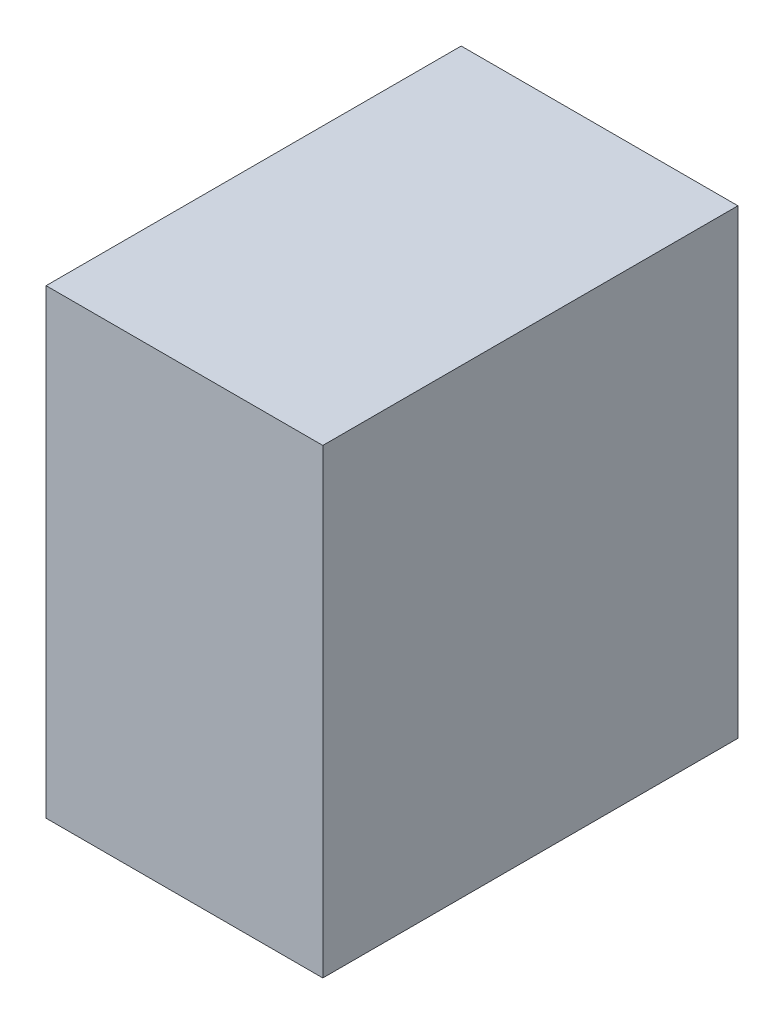
ISO-10303-21;
HEADER;
FILE_DESCRIPTION(('STEP AP214'),'2;1');
FILE_NAME('part.step','',(''),(''),'','','');
FILE_SCHEMA(('AUTOMOTIVE_DESIGN { 1 0 10303 214 1 1 1 1 }'));
ENDSEC;
DATA;
#1=APPLICATION_CONTEXT('core data for automotive mechanical design processes');
#2=APPLICATION_PROTOCOL_DEFINITION('international standard','automotive_design',2000,#1);
#3=PRODUCT_CONTEXT('',#1,'mechanical');
#4=PRODUCT('Part','Part','',(#3));
#5=PRODUCT_RELATED_PRODUCT_CATEGORY('part','',(#4));
#6=PRODUCT_DEFINITION_FORMATION('','',#4);
#7=PRODUCT_DEFINITION_CONTEXT('part definition',#1,'design');
#8=PRODUCT_DEFINITION('design','',#6,#7);
#9=PRODUCT_DEFINITION_SHAPE('','',#8);
#10=(LENGTH_UNIT() NAMED_UNIT(*) SI_UNIT(.MILLI.,.METRE.));
#11=(NAMED_UNIT(*) PLANE_ANGLE_UNIT() SI_UNIT($,.RADIAN.));
#12=(NAMED_UNIT(*) SI_UNIT($,.STERADIAN.) SOLID_ANGLE_UNIT());
#13=UNCERTAINTY_MEASURE_WITH_UNIT(LENGTH_MEASURE(1.E-05),#10,'distance_accuracy_value','');
#14=(GEOMETRIC_REPRESENTATION_CONTEXT(3) GLOBAL_UNCERTAINTY_ASSIGNED_CONTEXT((#13)) GLOBAL_UNIT_ASSIGNED_CONTEXT((#10,
#11,#12)) REPRESENTATION_CONTEXT('',''));
#15=CARTESIAN_POINT('',(0.,0.,0.));
#16=DIRECTION('',(0.,0.,1.));
#17=DIRECTION('',(1.,0.,0.));
#18=AXIS2_PLACEMENT_3D('',#15,#16,#17);
#19=CARTESIAN_POINT('',(3.30000012239185,0.699999208821872,-3.30112145980015));
#20=DIRECTION('',(1.,-1.74845553146952E-07,0.));
#21=DIRECTION('',(1.74845553146952E-07,1.,8.74227765734759E-08));
#22=AXIS2_PLACEMENT_3D('',#19,#20,#21);
#23=PLANE('',#22);
#24=DIRECTION('',(-1.74845553146599E-07,-0.999999999999981,-8.74227765732993E-08));
#25=VECTOR('',#24,1.);
#26=CARTESIAN_POINT('',(3.30000030597967,1.74999912577223,-2.35112136800623));
#27=LINE('',#26,#25);
#28=CARTESIAN_POINT('',(3.30000030598067,1.74999912577123,-2.35112136800623));
#29=VERTEX_POINT('',#28);
#30=CARTESIAN_POINT('',(3.30000013113511,0.749999125770234,-2.35112145543001));
#31=VERTEX_POINT('',#30);
#32=EDGE_CURVE('E11',#29,#31,#27,.T.);
#33=ORIENTED_EDGE('',*,*,#32,.F.);
#34=DIRECTION('',(0.,-8.7422776672162E-08,0.999999999999996));
#35=VECTOR('',#34,1.);
#36=CARTESIAN_POINT('',(3.30000030597968,1.74999920445273,-3.25112136800623));
#37=LINE('',#36,#35);
#38=CARTESIAN_POINT('',(3.30000030598068,1.74999920445273,-3.25112136800523));
#39=VERTEX_POINT('',#38);
#40=EDGE_CURVE('E59',#39,#29,#37,.T.);
#41=ORIENTED_EDGE('',*,*,#40,.F.);
#42=DIRECTION('',(1.74845553146599E-07,0.999999999999981,8.74227765732994E-08));
#43=VECTOR('',#42,1.);
#44=CARTESIAN_POINT('',(3.30000013113413,0.749999204450733,-3.25112145542901));
#45=LINE('',#44,#43);
#46=CARTESIAN_POINT('',(3.30000013113513,0.749999204451733,-3.25112145542901));
#47=VERTEX_POINT('',#46);
#48=EDGE_CURVE('E79',#47,#39,#45,.T.);
#49=ORIENTED_EDGE('',*,*,#48,.F.);
#50=DIRECTION('',(0.,8.74227765488039E-08,-0.999999999999996));
#51=VECTOR('',#50,1.);
#52=CARTESIAN_POINT('',(3.30000013113411,0.749999125770234,-2.35112145542901));
#53=LINE('',#52,#51);
#54=EDGE_CURVE('E84',#31,#47,#53,.T.);
#55=ORIENTED_EDGE('',*,*,#54,.F.);
#56=EDGE_LOOP('',(#33,#41,#49,#55));
#57=FACE_BOUND('',#56,.T.);
#58=ADVANCED_FACE('F17',(#57),#23,.F.);
#59=CARTESIAN_POINT('',(3.90000012239185,0.69999910391454,-3.30112145980015));
#60=DIRECTION('',(1.,-1.74845553146952E-07,0.));
#61=DIRECTION('',(1.74845553146952E-07,1.,8.74227765734759E-08));
#62=AXIS2_PLACEMENT_3D('',#59,#60,#61);
#63=PLANE('',#62);
#64=DIRECTION('',(0.,8.7422776672162E-08,-0.999999999999996));
#65=VECTOR('',#64,1.);
#66=CARTESIAN_POINT('',(3.90000013113411,0.749999020862902,-2.35112145542901));
#67=LINE('',#66,#65);
#68=CARTESIAN_POINT('',(3.90000013113311,0.749999020862903,-2.35112145543001));
#69=VERTEX_POINT('',#68);
#70=CARTESIAN_POINT('',(3.90000013113313,0.749999099544401,-3.25112145542901));
#71=VERTEX_POINT('',#70);
#72=EDGE_CURVE('E24',#69,#71,#67,.T.);
#73=ORIENTED_EDGE('',*,*,#72,.T.);
#74=DIRECTION('',(1.74845553146599E-07,0.999999999999981,8.74227765732993E-08));
#75=VECTOR('',#74,1.);
#76=CARTESIAN_POINT('',(3.90000013113413,0.749999099543401,-3.25112145542901));
#77=LINE('',#76,#75);
#78=CARTESIAN_POINT('',(3.90000030597868,1.7499990995454,-3.25112136800523));
#79=VERTEX_POINT('',#78);
#80=EDGE_CURVE('E82',#71,#79,#77,.T.);
#81=ORIENTED_EDGE('',*,*,#80,.T.);
#82=DIRECTION('',(0.,-8.7422776672162E-08,0.999999999999996));
#83=VECTOR('',#82,1.);
#84=CARTESIAN_POINT('',(3.90000030597968,1.7499990995454,-3.25112136800623));
#85=LINE('',#84,#83);
#86=CARTESIAN_POINT('',(3.90000030597867,1.7499990208639,-2.35112136800623));
#87=VERTEX_POINT('',#86);
#88=EDGE_CURVE('E64',#79,#87,#85,.T.);
#89=ORIENTED_EDGE('',*,*,#88,.T.);
#90=DIRECTION('',(-1.74845553146599E-07,-0.999999999999981,-8.74227765732993E-08));
#91=VECTOR('',#90,1.);
#92=CARTESIAN_POINT('',(3.90000030597967,1.7499990208649,-2.35112136800624));
#93=LINE('',#92,#91);
#94=EDGE_CURVE('E61',#87,#69,#93,.T.);
#95=ORIENTED_EDGE('',*,*,#94,.T.);
#96=EDGE_LOOP('',(#73,#81,#89,#95));
#97=FACE_BOUND('',#96,.T.);
#98=ADVANCED_FACE('F62',(#97),#63,.T.);
#99=CARTESIAN_POINT('',(3.30000013113411,0.749999125770234,-2.35112145542901));
#100=DIRECTION('',(-1.74845553146952E-07,-1.,-8.74227765734759E-08));
#101=DIRECTION('',(0.,8.74227765734759E-08,-1.));
#102=AXIS2_PLACEMENT_3D('',#99,#100,#101);
#103=PLANE('',#102);
#104=ORIENTED_EDGE('',*,*,#54,.T.);
#105=DIRECTION('',(0.999999999999985,-1.74845553220964E-07,0.));
#106=VECTOR('',#105,1.);
#107=CARTESIAN_POINT('',(3.30000013113413,0.749999204450733,-3.25112145542901));
#108=LINE('',#107,#106);
#109=EDGE_CURVE('E57',#47,#71,#108,.T.);
#110=ORIENTED_EDGE('',*,*,#109,.T.);
#111=ORIENTED_EDGE('',*,*,#72,.F.);
#112=DIRECTION('',(0.999999999999985,-1.74845553220964E-07,0.));
#113=VECTOR('',#112,1.);
#114=CARTESIAN_POINT('',(3.30000013113411,0.749999125770234,-2.35112145542901));
#115=LINE('',#114,#113);
#116=EDGE_CURVE('E55',#31,#69,#115,.T.);
#117=ORIENTED_EDGE('',*,*,#116,.F.);
#118=EDGE_LOOP('',(#104,#110,#111,#117));
#119=FACE_BOUND('',#118,.T.);
#120=ADVANCED_FACE('F53',(#119),#103,.T.);
#121=CARTESIAN_POINT('',(3.30000013113413,0.749999204450733,-3.25112145542901));
#122=DIRECTION('',(0.,8.74227765734759E-08,-1.));
#123=DIRECTION('',(1.74845553146952E-07,1.,8.74227765734759E-08));
#124=AXIS2_PLACEMENT_3D('',#121,#122,#123);
#125=PLANE('',#124);
#126=ORIENTED_EDGE('',*,*,#48,.T.);
#127=DIRECTION('',(0.999999999999985,-1.74845553220964E-07,0.));
#128=VECTOR('',#127,1.);
#129=CARTESIAN_POINT('',(3.30000030597968,1.74999920445273,-3.25112136800623));
#130=LINE('',#129,#128);
#131=EDGE_CURVE('E68',#39,#79,#130,.T.);
#132=ORIENTED_EDGE('',*,*,#131,.T.);
#133=ORIENTED_EDGE('',*,*,#80,.F.);
#134=ORIENTED_EDGE('',*,*,#109,.F.);
#135=EDGE_LOOP('',(#126,#132,#133,#134));
#136=FACE_BOUND('',#135,.T.);
#137=ADVANCED_FACE('F91',(#136),#125,.T.);
#138=CARTESIAN_POINT('',(3.30000030597968,1.74999920445273,-3.25112136800623));
#139=DIRECTION('',(1.74845553146952E-07,1.,8.74227765734759E-08));
#140=DIRECTION('',(0.,-8.74227765734759E-08,1.));
#141=AXIS2_PLACEMENT_3D('',#138,#139,#140);
#142=PLANE('',#141);
#143=ORIENTED_EDGE('',*,*,#40,.T.);
#144=DIRECTION('',(0.999999999999985,-1.74845553220964E-07,0.));
#145=VECTOR('',#144,1.);
#146=CARTESIAN_POINT('',(3.30000030597967,1.74999912577223,-2.35112136800623));
#147=LINE('',#146,#145);
#148=EDGE_CURVE('E69',#29,#87,#147,.T.);
#149=ORIENTED_EDGE('',*,*,#148,.T.);
#150=ORIENTED_EDGE('',*,*,#88,.F.);
#151=ORIENTED_EDGE('',*,*,#131,.F.);
#152=EDGE_LOOP('',(#143,#149,#150,#151));
#153=FACE_BOUND('',#152,.T.);
#154=ADVANCED_FACE('F88',(#153),#142,.T.);
#155=CARTESIAN_POINT('',(3.30000030597967,1.74999912577223,-2.35112136800623));
#156=DIRECTION('',(0.,-8.74227765734759E-08,1.));
#157=DIRECTION('',(-1.74845553146952E-07,-1.,-8.74227765734759E-08));
#158=AXIS2_PLACEMENT_3D('',#155,#156,#157);
#159=PLANE('',#158);
#160=ORIENTED_EDGE('',*,*,#32,.T.);
#161=ORIENTED_EDGE('',*,*,#116,.T.);
#162=ORIENTED_EDGE('',*,*,#94,.F.);
#163=ORIENTED_EDGE('',*,*,#148,.F.);
#164=EDGE_LOOP('',(#160,#161,#162,#163));
#165=FACE_BOUND('',#164,.T.);
#166=ADVANCED_FACE('F71',(#165),#159,.T.);
#167=CLOSED_SHELL('',(#58,#98,#120,#137,#154,#166));
#168=MANIFOLD_SOLID_BREP('B1',#167);
#169=ADVANCED_BREP_SHAPE_REPRESENTATION('',(#18,#168),#14);
#170=SHAPE_DEFINITION_REPRESENTATION(#9,#169);
ENDSEC;
END-ISO-10303-21;
